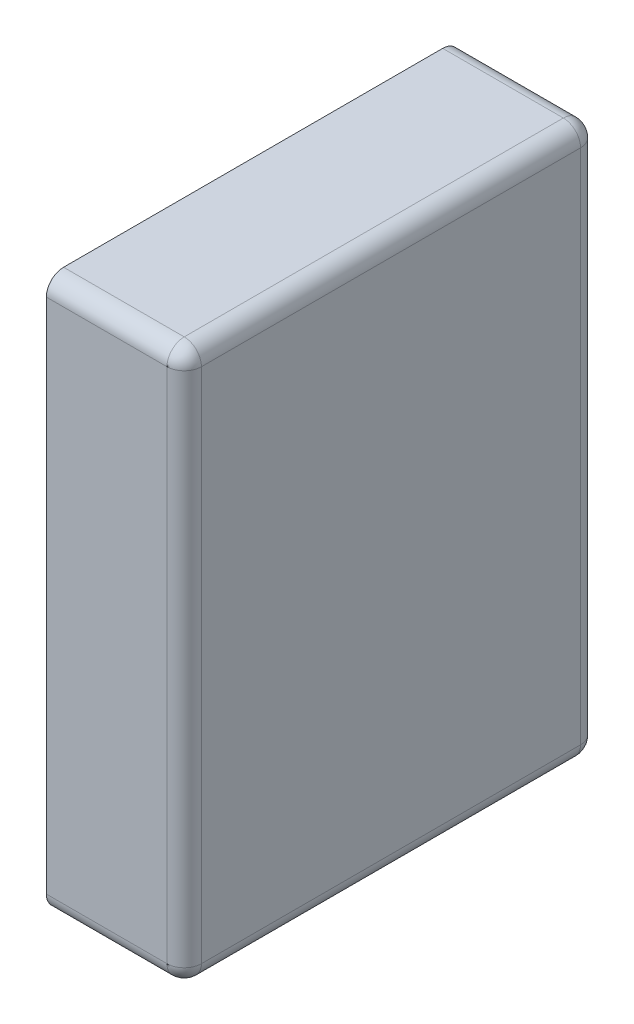
ISO-10303-21;
HEADER;
FILE_DESCRIPTION(('STEP AP214'),'2;1');
FILE_NAME('part.step','',(''),(''),'','','');
FILE_SCHEMA(('AUTOMOTIVE_DESIGN { 1 0 10303 214 1 1 1 1 }'));
ENDSEC;
DATA;
#1=APPLICATION_CONTEXT('core data for automotive mechanical design processes');
#2=APPLICATION_PROTOCOL_DEFINITION('international standard','automotive_design',2000,#1);
#3=PRODUCT_CONTEXT('',#1,'mechanical');
#4=PRODUCT('Part','Part','',(#3));
#5=PRODUCT_RELATED_PRODUCT_CATEGORY('part','',(#4));
#6=PRODUCT_DEFINITION_FORMATION('','',#4);
#7=PRODUCT_DEFINITION_CONTEXT('part definition',#1,'design');
#8=PRODUCT_DEFINITION('design','',#6,#7);
#9=PRODUCT_DEFINITION_SHAPE('','',#8);
#10=(LENGTH_UNIT() NAMED_UNIT(*) SI_UNIT(.MILLI.,.METRE.));
#11=(NAMED_UNIT(*) PLANE_ANGLE_UNIT() SI_UNIT($,.RADIAN.));
#12=(NAMED_UNIT(*) SI_UNIT($,.STERADIAN.) SOLID_ANGLE_UNIT());
#13=UNCERTAINTY_MEASURE_WITH_UNIT(LENGTH_MEASURE(1.E-05),#10,'distance_accuracy_value','');
#14=(GEOMETRIC_REPRESENTATION_CONTEXT(3) GLOBAL_UNCERTAINTY_ASSIGNED_CONTEXT((#13)) GLOBAL_UNIT_ASSIGNED_CONTEXT((#10,
#11,#12)) REPRESENTATION_CONTEXT('',''));
#15=CARTESIAN_POINT('',(0.,0.,0.));
#16=DIRECTION('',(0.,0.,1.));
#17=DIRECTION('',(1.,0.,0.));
#18=AXIS2_PLACEMENT_3D('',#15,#16,#17);
#19=CARTESIAN_POINT('',(0.775,-0.375,0.3));
#20=DIRECTION('',(0.,0.,-1.));
#21=DIRECTION('',(1.,0.,0.));
#22=AXIS2_PLACEMENT_3D('',#19,#20,#21);
#23=CYLINDRICAL_SURFACE('',#22,0.025);
#24=CARTESIAN_POINT('',(0.775,-0.375,0.025));
#25=DIRECTION('',(0.,0.,1.));
#26=DIRECTION('',(0.,1.,0.));
#27=AXIS2_PLACEMENT_3D('',#24,#25,#26);
#28=CIRCLE('',#27,0.025);
#29=CARTESIAN_POINT('',(0.775,-0.4,0.025));
#30=VERTEX_POINT('',#29);
#31=CARTESIAN_POINT('',(0.8,-0.375,0.025));
#32=VERTEX_POINT('',#31);
#33=EDGE_CURVE('E11',#30,#32,#28,.T.);
#34=ORIENTED_EDGE('',*,*,#33,.T.);
#35=DIRECTION('',(0.,0.,-1.));
#36=VECTOR('',#35,1.);
#37=CARTESIAN_POINT('',(0.8,-0.375,0.));
#38=LINE('',#37,#36);
#39=CARTESIAN_POINT('',(0.8,-0.375,0.575));
#40=VERTEX_POINT('',#39);
#41=EDGE_CURVE('E102',#40,#32,#38,.T.);
#42=ORIENTED_EDGE('',*,*,#41,.F.);
#43=CARTESIAN_POINT('',(0.775,-0.375,0.575));
#44=DIRECTION('',(0.,0.,1.));
#45=DIRECTION('',(1.,0.,0.));
#46=AXIS2_PLACEMENT_3D('',#43,#44,#45);
#47=CIRCLE('',#46,0.025);
#48=CARTESIAN_POINT('',(0.775,-0.4,0.575));
#49=VERTEX_POINT('',#48);
#50=EDGE_CURVE('E154',#49,#40,#47,.T.);
#51=ORIENTED_EDGE('',*,*,#50,.F.);
#52=DIRECTION('',(0.,0.,1.));
#53=VECTOR('',#52,1.);
#54=CARTESIAN_POINT('',(0.775,-0.4,0.6));
#55=LINE('',#54,#53);
#56=EDGE_CURVE('E103',#30,#49,#55,.T.);
#57=ORIENTED_EDGE('',*,*,#56,.F.);
#58=EDGE_LOOP('',(#34,#42,#51,#57));
#59=FACE_BOUND('',#58,.T.);
#60=ADVANCED_FACE('F17',(#59),#23,.T.);
#61=CARTESIAN_POINT('',(0.775,0.375,0.025));
#62=DIRECTION('',(0.,0.,1.));
#63=DIRECTION('',(1.,0.,0.));
#64=AXIS2_PLACEMENT_3D('',#61,#62,#63);
#65=SPHERICAL_SURFACE('',#64,0.025);
#66=CARTESIAN_POINT('',(0.775,0.375,0.025));
#67=DIRECTION('',(0.,1.,0.));
#68=DIRECTION('',(0.,0.,1.));
#69=AXIS2_PLACEMENT_3D('',#66,#67,#68);
#70=CIRCLE('',#69,0.025);
#71=CARTESIAN_POINT('',(0.8,0.375,0.025));
#72=VERTEX_POINT('',#71);
#73=CARTESIAN_POINT('',(0.775,0.375,0.));
#74=VERTEX_POINT('',#73);
#75=EDGE_CURVE('E209',#72,#74,#70,.T.);
#76=ORIENTED_EDGE('',*,*,#75,.T.);
#77=CARTESIAN_POINT('',(0.775,0.375,0.025));
#78=DIRECTION('',(1.,0.,0.));
#79=DIRECTION('',(0.,0.,-1.));
#80=AXIS2_PLACEMENT_3D('',#77,#78,#79);
#81=CIRCLE('',#80,0.025);
#82=CARTESIAN_POINT('',(0.775,0.4,0.025));
#83=VERTEX_POINT('',#82);
#84=EDGE_CURVE('E28',#74,#83,#81,.T.);
#85=ORIENTED_EDGE('',*,*,#84,.T.);
#86=CARTESIAN_POINT('',(0.775,0.375,0.025));
#87=DIRECTION('',(0.,0.,1.));
#88=DIRECTION('',(-1.,0.,0.));
#89=AXIS2_PLACEMENT_3D('',#86,#87,#88);
#90=CIRCLE('',#89,0.025);
#91=EDGE_CURVE('E141',#72,#83,#90,.T.);
#92=ORIENTED_EDGE('',*,*,#91,.F.);
#93=EDGE_LOOP('',(#76,#85,#92));
#94=FACE_BOUND('',#93,.T.);
#95=ADVANCED_FACE('F264',(#94),#65,.T.);
#96=CARTESIAN_POINT('',(0.775,-0.375,0.025));
#97=DIRECTION('',(0.,0.,1.));
#98=DIRECTION('',(1.,0.,0.));
#99=AXIS2_PLACEMENT_3D('',#96,#97,#98);
#100=SPHERICAL_SURFACE('',#99,0.025);
#101=CARTESIAN_POINT('',(0.775,-0.375,0.025));
#102=DIRECTION('',(1.,0.,0.));
#103=DIRECTION('',(0.,0.,-1.));
#104=AXIS2_PLACEMENT_3D('',#101,#102,#103);
#105=CIRCLE('',#104,0.025);
#106=CARTESIAN_POINT('',(0.775,-0.375,0.));
#107=VERTEX_POINT('',#106);
#108=EDGE_CURVE('E185',#30,#107,#105,.T.);
#109=ORIENTED_EDGE('',*,*,#108,.T.);
#110=CARTESIAN_POINT('',(0.775,-0.375,0.025));
#111=DIRECTION('',(0.,-1.,0.));
#112=DIRECTION('',(0.,0.,-1.));
#113=AXIS2_PLACEMENT_3D('',#110,#111,#112);
#114=CIRCLE('',#113,0.025);
#115=EDGE_CURVE('E158',#107,#32,#114,.T.);
#116=ORIENTED_EDGE('',*,*,#115,.T.);
#117=ORIENTED_EDGE('',*,*,#33,.F.);
#118=EDGE_LOOP('',(#109,#116,#117));
#119=FACE_BOUND('',#118,.T.);
#120=ADVANCED_FACE('F300',(#119),#100,.T.);
#121=CARTESIAN_POINT('',(0.4,0.375,0.025));
#122=DIRECTION('',(1.,0.,0.));
#123=DIRECTION('',(0.,0.,1.));
#124=AXIS2_PLACEMENT_3D('',#121,#122,#123);
#125=CYLINDRICAL_SURFACE('',#124,0.025);
#126=CARTESIAN_POINT('',(0.6,0.375,0.025));
#127=DIRECTION('',(-1.,0.,0.));
#128=DIRECTION('',(0.,0.,-1.));
#129=AXIS2_PLACEMENT_3D('',#126,#127,#128);
#130=CIRCLE('',#129,0.025);
#131=CARTESIAN_POINT('',(0.6,0.4,0.025));
#132=VERTEX_POINT('',#131);
#133=CARTESIAN_POINT('',(0.6,0.375,0.));
#134=VERTEX_POINT('',#133);
#135=EDGE_CURVE('E107',#132,#134,#130,.T.);
#136=ORIENTED_EDGE('',*,*,#135,.F.);
#137=DIRECTION('',(-1.,0.,0.));
#138=VECTOR('',#137,1.);
#139=CARTESIAN_POINT('',(0.4,0.4,0.025));
#140=LINE('',#139,#138);
#141=EDGE_CURVE('E90',#83,#132,#140,.T.);
#142=ORIENTED_EDGE('',*,*,#141,.F.);
#143=ORIENTED_EDGE('',*,*,#84,.F.);
#144=DIRECTION('',(1.,0.,0.));
#145=VECTOR('',#144,1.);
#146=CARTESIAN_POINT('',(0.7,0.375,0.));
#147=LINE('',#146,#145);
#148=EDGE_CURVE('E110',#134,#74,#147,.T.);
#149=ORIENTED_EDGE('',*,*,#148,.F.);
#150=EDGE_LOOP('',(#136,#142,#143,#149));
#151=FACE_BOUND('',#150,.T.);
#152=ADVANCED_FACE('F108',(#151),#125,.T.);
#153=CARTESIAN_POINT('',(0.7,-0.375,0.025));
#154=DIRECTION('',(-1.,0.,0.));
#155=DIRECTION('',(0.,0.,-1.));
#156=AXIS2_PLACEMENT_3D('',#153,#154,#155);
#157=CYLINDRICAL_SURFACE('',#156,0.025);
#158=CARTESIAN_POINT('',(0.6,-0.375,0.025));
#159=DIRECTION('',(-1.,0.,0.));
#160=DIRECTION('',(0.,0.,-1.));
#161=AXIS2_PLACEMENT_3D('',#158,#159,#160);
#162=CIRCLE('',#161,0.025);
#163=CARTESIAN_POINT('',(0.6,-0.375,0.));
#164=VERTEX_POINT('',#163);
#165=CARTESIAN_POINT('',(0.6,-0.4,0.025));
#166=VERTEX_POINT('',#165);
#167=EDGE_CURVE('E134',#164,#166,#162,.T.);
#168=ORIENTED_EDGE('',*,*,#167,.F.);
#169=DIRECTION('',(-1.,0.,0.));
#170=VECTOR('',#169,1.);
#171=CARTESIAN_POINT('',(0.6,-0.375,0.));
#172=LINE('',#171,#170);
#173=EDGE_CURVE('E181',#107,#164,#172,.T.);
#174=ORIENTED_EDGE('',*,*,#173,.F.);
#175=ORIENTED_EDGE('',*,*,#108,.F.);
#176=DIRECTION('',(1.,0.,0.));
#177=VECTOR('',#176,1.);
#178=CARTESIAN_POINT('',(0.8,-0.4,0.025));
#179=LINE('',#178,#177);
#180=EDGE_CURVE('E216',#166,#30,#179,.T.);
#181=ORIENTED_EDGE('',*,*,#180,.F.);
#182=EDGE_LOOP('',(#168,#174,#175,#181));
#183=FACE_BOUND('',#182,.T.);
#184=ADVANCED_FACE('F270',(#183),#157,.T.);
#185=CARTESIAN_POINT('',(0.7,-0.4,0.));
#186=DIRECTION('',(0.,0.,1.));
#187=DIRECTION('',(1.,0.,0.));
#188=AXIS2_PLACEMENT_3D('',#185,#186,#187);
#189=PLANE('',#188);
#190=DIRECTION('',(0.,-1.,0.));
#191=VECTOR('',#190,1.);
#192=CARTESIAN_POINT('',(0.775,-0.4,0.));
#193=LINE('',#192,#191);
#194=EDGE_CURVE('E162',#74,#107,#193,.T.);
#195=ORIENTED_EDGE('',*,*,#194,.T.);
#196=ORIENTED_EDGE('',*,*,#173,.T.);
#197=DIRECTION('',(0.,1.,0.));
#198=VECTOR('',#197,1.);
#199=CARTESIAN_POINT('',(0.6,-0.4,0.));
#200=LINE('',#199,#198);
#201=EDGE_CURVE('E137',#164,#134,#200,.T.);
#202=ORIENTED_EDGE('',*,*,#201,.T.);
#203=ORIENTED_EDGE('',*,*,#148,.T.);
#204=EDGE_LOOP('',(#195,#196,#202,#203));
#205=FACE_BOUND('',#204,.T.);
#206=ADVANCED_FACE('F267',(#205),#189,.F.);
#207=CARTESIAN_POINT('',(0.8,-0.4,0.3));
#208=DIRECTION('',(-1.,0.,0.));
#209=DIRECTION('',(0.,0.,1.));
#210=AXIS2_PLACEMENT_3D('',#207,#208,#209);
#211=PLANE('',#210);
#212=DIRECTION('',(0.,-1.,0.));
#213=VECTOR('',#212,1.);
#214=CARTESIAN_POINT('',(0.8,-0.4,0.575));
#215=LINE('',#214,#213);
#216=CARTESIAN_POINT('',(0.8,0.375,0.575));
#217=VERTEX_POINT('',#216);
#218=EDGE_CURVE('E188',#217,#40,#215,.T.);
#219=ORIENTED_EDGE('',*,*,#218,.T.);
#220=ORIENTED_EDGE('',*,*,#41,.T.);
#221=DIRECTION('',(0.,1.,0.));
#222=VECTOR('',#221,1.);
#223=CARTESIAN_POINT('',(0.8,-0.4,0.025));
#224=LINE('',#223,#222);
#225=EDGE_CURVE('E213',#32,#72,#224,.T.);
#226=ORIENTED_EDGE('',*,*,#225,.T.);
#227=DIRECTION('',(0.,0.,1.));
#228=VECTOR('',#227,1.);
#229=CARTESIAN_POINT('',(0.8,0.375,0.3));
#230=LINE('',#229,#228);
#231=EDGE_CURVE('E149',#72,#217,#230,.T.);
#232=ORIENTED_EDGE('',*,*,#231,.T.);
#233=EDGE_LOOP('',(#219,#220,#226,#232));
#234=FACE_BOUND('',#233,.T.);
#235=ADVANCED_FACE('F318',(#234),#211,.F.);
#236=CARTESIAN_POINT('',(0.4,0.4,0.3));
#237=DIRECTION('',(0.,-1.,0.));
#238=DIRECTION('',(0.,0.,-1.));
#239=AXIS2_PLACEMENT_3D('',#236,#237,#238);
#240=PLANE('',#239);
#241=DIRECTION('',(0.,0.,-1.));
#242=VECTOR('',#241,1.);
#243=CARTESIAN_POINT('',(0.775,0.4,0.3));
#244=LINE('',#243,#242);
#245=CARTESIAN_POINT('',(0.775,0.4,0.575));
#246=VERTEX_POINT('',#245);
#247=EDGE_CURVE('E98',#246,#83,#244,.T.);
#248=ORIENTED_EDGE('',*,*,#247,.T.);
#249=ORIENTED_EDGE('',*,*,#141,.T.);
#250=DIRECTION('',(0.,0.,1.));
#251=VECTOR('',#250,1.);
#252=CARTESIAN_POINT('',(0.6,0.4,0.499600058));
#253=LINE('',#252,#251);
#254=CARTESIAN_POINT('',(0.6,0.4,0.575));
#255=VERTEX_POINT('',#254);
#256=EDGE_CURVE('E95',#132,#255,#253,.T.);
#257=ORIENTED_EDGE('',*,*,#256,.T.);
#258=DIRECTION('',(1.,0.,0.));
#259=VECTOR('',#258,1.);
#260=CARTESIAN_POINT('',(0.4,0.4,0.575));
#261=LINE('',#260,#259);
#262=EDGE_CURVE('E142',#255,#246,#261,.T.);
#263=ORIENTED_EDGE('',*,*,#262,.T.);
#264=EDGE_LOOP('',(#248,#249,#257,#263));
#265=FACE_BOUND('',#264,.T.);
#266=ADVANCED_FACE('F92',(#265),#240,.F.);
#267=CARTESIAN_POINT('',(0.4,-0.4,0.3));
#268=DIRECTION('',(0.,-1.,0.));
#269=DIRECTION('',(0.,0.,-1.));
#270=AXIS2_PLACEMENT_3D('',#267,#268,#269);
#271=PLANE('',#270);
#272=DIRECTION('',(0.,0.,1.));
#273=VECTOR('',#272,1.);
#274=CARTESIAN_POINT('',(0.6,-0.4,0.499600058));
#275=LINE('',#274,#273);
#276=CARTESIAN_POINT('',(0.6,-0.4,0.575));
#277=VERTEX_POINT('',#276);
#278=EDGE_CURVE('E129',#166,#277,#275,.T.);
#279=ORIENTED_EDGE('',*,*,#278,.F.);
#280=ORIENTED_EDGE('',*,*,#180,.T.);
#281=ORIENTED_EDGE('',*,*,#56,.T.);
#282=DIRECTION('',(-1.,0.,0.));
#283=VECTOR('',#282,1.);
#284=CARTESIAN_POINT('',(0.6,-0.4,0.575));
#285=LINE('',#284,#283);
#286=EDGE_CURVE('E169',#49,#277,#285,.T.);
#287=ORIENTED_EDGE('',*,*,#286,.T.);
#288=EDGE_LOOP('',(#279,#280,#281,#287));
#289=FACE_BOUND('',#288,.T.);
#290=ADVANCED_FACE('F276',(#289),#271,.T.);
#291=CARTESIAN_POINT('',(0.775,-0.4,0.025));
#292=DIRECTION('',(0.,-1.,0.));
#293=DIRECTION('',(0.,0.,1.));
#294=AXIS2_PLACEMENT_3D('',#291,#292,#293);
#295=CYLINDRICAL_SURFACE('',#294,0.025);
#296=ORIENTED_EDGE('',*,*,#115,.F.);
#297=ORIENTED_EDGE('',*,*,#194,.F.);
#298=ORIENTED_EDGE('',*,*,#75,.F.);
#299=ORIENTED_EDGE('',*,*,#225,.F.);
#300=EDGE_LOOP('',(#296,#297,#298,#299));
#301=FACE_BOUND('',#300,.T.);
#302=ADVANCED_FACE('F282',(#301),#295,.T.);
#303=CARTESIAN_POINT('',(0.775,-0.375,0.575));
#304=DIRECTION('',(0.,0.,1.));
#305=DIRECTION('',(1.,0.,0.));
#306=AXIS2_PLACEMENT_3D('',#303,#304,#305);
#307=SPHERICAL_SURFACE('',#306,0.025);
#308=CARTESIAN_POINT('',(0.775,-0.375,0.575));
#309=DIRECTION('',(1.,0.,0.));
#310=DIRECTION('',(0.,0.,-1.));
#311=AXIS2_PLACEMENT_3D('',#308,#309,#310);
#312=CIRCLE('',#311,0.025);
#313=CARTESIAN_POINT('',(0.775,-0.375,0.6));
#314=VERTEX_POINT('',#313);
#315=EDGE_CURVE('E173',#314,#49,#312,.T.);
#316=ORIENTED_EDGE('',*,*,#315,.T.);
#317=ORIENTED_EDGE('',*,*,#50,.T.);
#318=CARTESIAN_POINT('',(0.775,-0.375,0.575));
#319=DIRECTION('',(0.,1.,0.));
#320=DIRECTION('',(0.,0.,-1.));
#321=AXIS2_PLACEMENT_3D('',#318,#319,#320);
#322=CIRCLE('',#321,0.025);
#323=EDGE_CURVE('E21',#314,#40,#322,.T.);
#324=ORIENTED_EDGE('',*,*,#323,.F.);
#325=EDGE_LOOP('',(#316,#317,#324));
#326=FACE_BOUND('',#325,.T.);
#327=ADVANCED_FACE('F279',(#326),#307,.T.);
#328=CARTESIAN_POINT('',(0.775,0.375,0.575));
#329=DIRECTION('',(0.,0.,1.));
#330=DIRECTION('',(1.,0.,0.));
#331=AXIS2_PLACEMENT_3D('',#328,#329,#330);
#332=SPHERICAL_SURFACE('',#331,0.025);
#333=CARTESIAN_POINT('',(0.775,0.375,0.575));
#334=DIRECTION('',(0.,0.,1.));
#335=DIRECTION('',(1.,0.,0.));
#336=AXIS2_PLACEMENT_3D('',#333,#334,#335);
#337=CIRCLE('',#336,0.025);
#338=EDGE_CURVE('E140',#217,#246,#337,.T.);
#339=ORIENTED_EDGE('',*,*,#338,.T.);
#340=CARTESIAN_POINT('',(0.775,0.375,0.575));
#341=DIRECTION('',(1.,0.,0.));
#342=DIRECTION('',(0.,0.,-1.));
#343=AXIS2_PLACEMENT_3D('',#340,#341,#342);
#344=CIRCLE('',#343,0.025);
#345=CARTESIAN_POINT('',(0.775,0.375,0.6));
#346=VERTEX_POINT('',#345);
#347=EDGE_CURVE('E144',#246,#346,#344,.T.);
#348=ORIENTED_EDGE('',*,*,#347,.T.);
#349=CARTESIAN_POINT('',(0.775,0.375,0.575));
#350=DIRECTION('',(0.,-1.,0.));
#351=DIRECTION('',(0.,0.,1.));
#352=AXIS2_PLACEMENT_3D('',#349,#350,#351);
#353=CIRCLE('',#352,0.025);
#354=EDGE_CURVE('E159',#217,#346,#353,.T.);
#355=ORIENTED_EDGE('',*,*,#354,.F.);
#356=EDGE_LOOP('',(#339,#348,#355));
#357=FACE_BOUND('',#356,.T.);
#358=ADVANCED_FACE('F281',(#357),#332,.T.);
#359=CARTESIAN_POINT('',(0.775,-0.4,0.575));
#360=DIRECTION('',(0.,-1.,0.));
#361=DIRECTION('',(0.,0.,1.));
#362=AXIS2_PLACEMENT_3D('',#359,#360,#361);
#363=CYLINDRICAL_SURFACE('',#362,0.025);
#364=ORIENTED_EDGE('',*,*,#323,.T.);
#365=ORIENTED_EDGE('',*,*,#218,.F.);
#366=ORIENTED_EDGE('',*,*,#354,.T.);
#367=DIRECTION('',(0.,1.,0.));
#368=VECTOR('',#367,1.);
#369=CARTESIAN_POINT('',(0.775,-0.4,0.6));
#370=LINE('',#369,#368);
#371=EDGE_CURVE('E115',#314,#346,#370,.T.);
#372=ORIENTED_EDGE('',*,*,#371,.F.);
#373=EDGE_LOOP('',(#364,#365,#366,#372));
#374=FACE_BOUND('',#373,.T.);
#375=ADVANCED_FACE('F289',(#374),#363,.T.);
#376=CARTESIAN_POINT('',(0.7,-0.4,0.6));
#377=DIRECTION('',(0.,0.,-1.));
#378=DIRECTION('',(0.,-1.,0.));
#379=AXIS2_PLACEMENT_3D('',#376,#377,#378);
#380=PLANE('',#379);
#381=DIRECTION('',(0.,1.,0.));
#382=VECTOR('',#381,1.);
#383=CARTESIAN_POINT('',(0.6,-0.4,0.6));
#384=LINE('',#383,#382);
#385=CARTESIAN_POINT('',(0.6,-0.375,0.6));
#386=VERTEX_POINT('',#385);
#387=CARTESIAN_POINT('',(0.6,0.375,0.6));
#388=VERTEX_POINT('',#387);
#389=EDGE_CURVE('E123',#386,#388,#384,.T.);
#390=ORIENTED_EDGE('',*,*,#389,.F.);
#391=DIRECTION('',(1.,0.,0.));
#392=VECTOR('',#391,1.);
#393=CARTESIAN_POINT('',(0.8,-0.375,0.6));
#394=LINE('',#393,#392);
#395=EDGE_CURVE('E178',#386,#314,#394,.T.);
#396=ORIENTED_EDGE('',*,*,#395,.T.);
#397=ORIENTED_EDGE('',*,*,#371,.T.);
#398=DIRECTION('',(-1.,0.,0.));
#399=VECTOR('',#398,1.);
#400=CARTESIAN_POINT('',(0.7,0.375,0.6));
#401=LINE('',#400,#399);
#402=EDGE_CURVE('E152',#346,#388,#401,.T.);
#403=ORIENTED_EDGE('',*,*,#402,.T.);
#404=EDGE_LOOP('',(#390,#396,#397,#403));
#405=FACE_BOUND('',#404,.T.);
#406=ADVANCED_FACE('F235',(#405),#380,.F.);
#407=CARTESIAN_POINT('',(0.6,-0.4,0.499600058));
#408=DIRECTION('',(1.,0.,0.));
#409=DIRECTION('',(0.,1.,0.));
#410=AXIS2_PLACEMENT_3D('',#407,#408,#409);
#411=PLANE('',#410);
#412=ORIENTED_EDGE('',*,*,#201,.F.);
#413=ORIENTED_EDGE('',*,*,#167,.T.);
#414=ORIENTED_EDGE('',*,*,#278,.T.);
#415=CARTESIAN_POINT('',(0.6,-0.375,0.575));
#416=DIRECTION('',(-1.,0.,0.));
#417=DIRECTION('',(0.,0.,-1.));
#418=AXIS2_PLACEMENT_3D('',#415,#416,#417);
#419=CIRCLE('',#418,0.025);
#420=EDGE_CURVE('E166',#277,#386,#419,.T.);
#421=ORIENTED_EDGE('',*,*,#420,.T.);
#422=ORIENTED_EDGE('',*,*,#389,.T.);
#423=CARTESIAN_POINT('',(0.6,0.375,0.575));
#424=DIRECTION('',(-1.,0.,0.));
#425=DIRECTION('',(0.,0.,-1.));
#426=AXIS2_PLACEMENT_3D('',#423,#424,#425);
#427=CIRCLE('',#426,0.025);
#428=EDGE_CURVE('E121',#388,#255,#427,.T.);
#429=ORIENTED_EDGE('',*,*,#428,.T.);
#430=ORIENTED_EDGE('',*,*,#256,.F.);
#431=ORIENTED_EDGE('',*,*,#135,.T.);
#432=EDGE_LOOP('',(#412,#413,#414,#421,#422,#429,#430,#431));
#433=FACE_BOUND('',#432,.T.);
#434=ADVANCED_FACE('F118',(#433),#411,.F.);
#435=CARTESIAN_POINT('',(0.7,-0.375,0.575));
#436=DIRECTION('',(1.,0.,0.));
#437=DIRECTION('',(0.,0.,1.));
#438=AXIS2_PLACEMENT_3D('',#435,#436,#437);
#439=CYLINDRICAL_SURFACE('',#438,0.025);
#440=ORIENTED_EDGE('',*,*,#420,.F.);
#441=ORIENTED_EDGE('',*,*,#286,.F.);
#442=ORIENTED_EDGE('',*,*,#315,.F.);
#443=ORIENTED_EDGE('',*,*,#395,.F.);
#444=EDGE_LOOP('',(#440,#441,#442,#443));
#445=FACE_BOUND('',#444,.T.);
#446=ADVANCED_FACE('F231',(#445),#439,.T.);
#447=CARTESIAN_POINT('',(0.775,0.375,0.3));
#448=DIRECTION('',(0.,0.,1.));
#449=DIRECTION('',(-1.,0.,0.));
#450=AXIS2_PLACEMENT_3D('',#447,#448,#449);
#451=CYLINDRICAL_SURFACE('',#450,0.025);
#452=ORIENTED_EDGE('',*,*,#91,.T.);
#453=ORIENTED_EDGE('',*,*,#247,.F.);
#454=ORIENTED_EDGE('',*,*,#338,.F.);
#455=ORIENTED_EDGE('',*,*,#231,.F.);
#456=EDGE_LOOP('',(#452,#453,#454,#455));
#457=FACE_BOUND('',#456,.T.);
#458=ADVANCED_FACE('F312',(#457),#451,.T.);
#459=CARTESIAN_POINT('',(0.4,0.375,0.575));
#460=DIRECTION('',(-1.,0.,0.));
#461=DIRECTION('',(0.,0.,-1.));
#462=AXIS2_PLACEMENT_3D('',#459,#460,#461);
#463=CYLINDRICAL_SURFACE('',#462,0.025);
#464=ORIENTED_EDGE('',*,*,#428,.F.);
#465=ORIENTED_EDGE('',*,*,#402,.F.);
#466=ORIENTED_EDGE('',*,*,#347,.F.);
#467=ORIENTED_EDGE('',*,*,#262,.F.);
#468=EDGE_LOOP('',(#464,#465,#466,#467));
#469=FACE_BOUND('',#468,.T.);
#470=ADVANCED_FACE('F19',(#469),#463,.T.);
#471=CLOSED_SHELL('',(#60,#95,#120,#152,#184,#206,#235,#266,#290,#302,#327,#358,#375,#406,#434,
#446,#458,#470));
#472=MANIFOLD_SOLID_BREP('B1',#471);
#473=ADVANCED_BREP_SHAPE_REPRESENTATION('',(#18,#472),#14);
#474=SHAPE_DEFINITION_REPRESENTATION(#9,#473);
ENDSEC;
END-ISO-10303-21;
